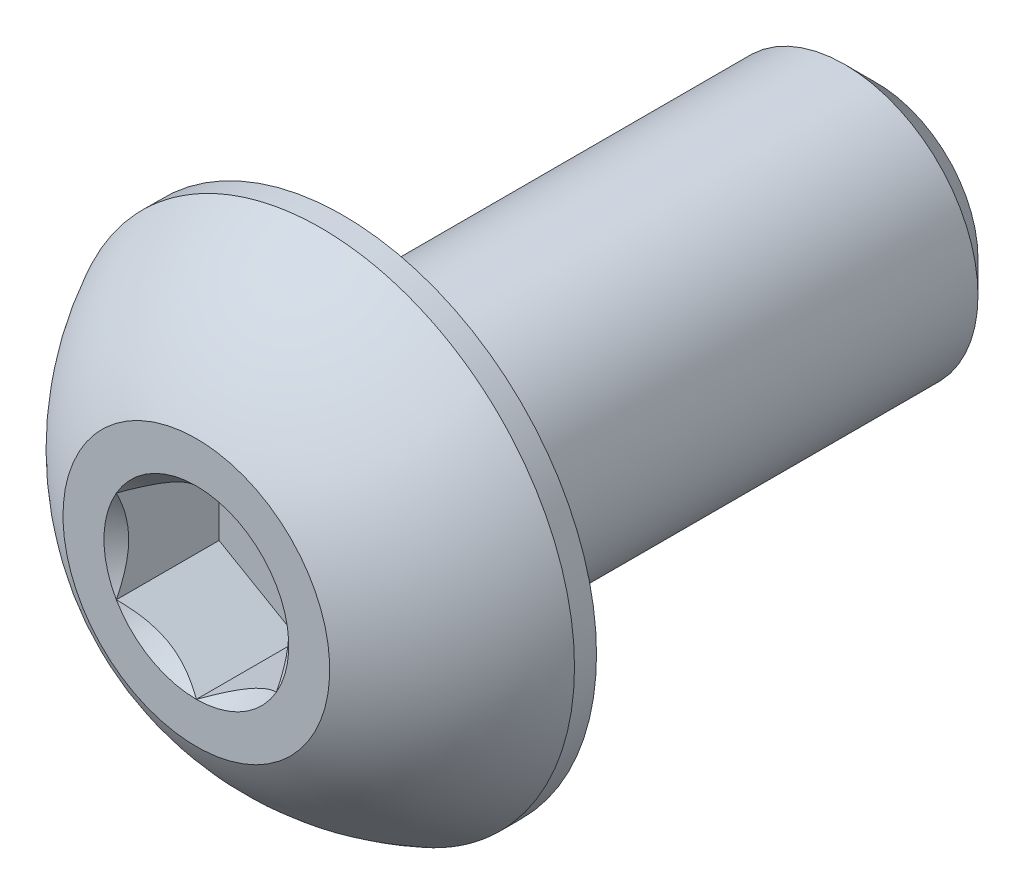
ISO-10303-21;
HEADER;
FILE_DESCRIPTION(('STEP AP214'),'2;1');
FILE_NAME('part.step','',(''),(''),'','','');
FILE_SCHEMA(('AUTOMOTIVE_DESIGN { 1 0 10303 214 1 1 1 1 }'));
ENDSEC;
DATA;
#1=APPLICATION_CONTEXT('core data for automotive mechanical design processes');
#2=APPLICATION_PROTOCOL_DEFINITION('international standard','automotive_design',2000,#1);
#3=PRODUCT_CONTEXT('',#1,'mechanical');
#4=PRODUCT('Part','Part','',(#3));
#5=PRODUCT_RELATED_PRODUCT_CATEGORY('part','',(#4));
#6=PRODUCT_DEFINITION_FORMATION('','',#4);
#7=PRODUCT_DEFINITION_CONTEXT('part definition',#1,'design');
#8=PRODUCT_DEFINITION('design','',#6,#7);
#9=PRODUCT_DEFINITION_SHAPE('','',#8);
#10=(LENGTH_UNIT() NAMED_UNIT(*) SI_UNIT(.MILLI.,.METRE.));
#11=(NAMED_UNIT(*) PLANE_ANGLE_UNIT() SI_UNIT($,.RADIAN.));
#12=(NAMED_UNIT(*) SI_UNIT($,.STERADIAN.) SOLID_ANGLE_UNIT());
#13=UNCERTAINTY_MEASURE_WITH_UNIT(LENGTH_MEASURE(1.E-05),#10,'distance_accuracy_value','');
#14=(GEOMETRIC_REPRESENTATION_CONTEXT(3) GLOBAL_UNCERTAINTY_ASSIGNED_CONTEXT((#13)) GLOBAL_UNIT_ASSIGNED_CONTEXT((#10,
#11,#12)) REPRESENTATION_CONTEXT('',''));
#15=CARTESIAN_POINT('',(0.,0.,0.));
#16=DIRECTION('',(0.,0.,1.));
#17=DIRECTION('',(1.,0.,0.));
#18=AXIS2_PLACEMENT_3D('',#15,#16,#17);
#19=CARTESIAN_POINT('',(1.5,-0.866025403784438,-1.925));
#20=DIRECTION('',(0.,0.,1.));
#21=DIRECTION('',(1.,0.,0.));
#22=AXIS2_PLACEMENT_3D('',#19,#20,#21);
#23=PLANE('',#22);
#24=DIRECTION('',(0.,1.,0.));
#25=VECTOR('',#24,1.);
#26=CARTESIAN_POINT('',(-1.5,0.866025403784438,-1.925));
#27=LINE('',#26,#25);
#28=CARTESIAN_POINT('',(-1.5,0.866025403784439,-1.925));
#29=VERTEX_POINT('',#28);
#30=CARTESIAN_POINT('',(-1.5,-0.866025403784439,-1.925));
#31=VERTEX_POINT('',#30);
#32=EDGE_CURVE('E67',#29,#31,#27,.F.);
#33=ORIENTED_EDGE('',*,*,#32,.T.);
#34=DIRECTION('',(0.866025403784439,-0.5,0.));
#35=VECTOR('',#34,1.);
#36=CARTESIAN_POINT('',(-1.5,-0.866025403784439,-1.925));
#37=LINE('',#36,#35);
#38=CARTESIAN_POINT('',(0.,-1.73205080756888,-1.925));
#39=VERTEX_POINT('',#38);
#40=EDGE_CURVE('E81',#31,#39,#37,.T.);
#41=ORIENTED_EDGE('',*,*,#40,.T.);
#42=DIRECTION('',(0.866025403784438,0.5,0.));
#43=VECTOR('',#42,1.);
#44=CARTESIAN_POINT('',(0.,-1.73205080756888,-1.925));
#45=LINE('',#44,#43);
#46=CARTESIAN_POINT('',(1.5,-0.866025403784439,-1.925));
#47=VERTEX_POINT('',#46);
#48=EDGE_CURVE('E84',#39,#47,#45,.T.);
#49=ORIENTED_EDGE('',*,*,#48,.T.);
#50=DIRECTION('',(0.,1.,0.));
#51=VECTOR('',#50,1.);
#52=CARTESIAN_POINT('',(1.5,-0.866025403784438,-1.925));
#53=LINE('',#52,#51);
#54=CARTESIAN_POINT('',(1.5,0.866025403784439,-1.925));
#55=VERTEX_POINT('',#54);
#56=EDGE_CURVE('E93',#47,#55,#53,.T.);
#57=ORIENTED_EDGE('',*,*,#56,.T.);
#58=DIRECTION('',(-0.866025403784439,0.5,0.));
#59=VECTOR('',#58,1.);
#60=CARTESIAN_POINT('',(1.5,0.866025403784439,-1.925));
#61=LINE('',#60,#59);
#62=CARTESIAN_POINT('',(0.,1.73205080756888,-1.925));
#63=VERTEX_POINT('',#62);
#64=EDGE_CURVE('E265',#55,#63,#61,.T.);
#65=ORIENTED_EDGE('',*,*,#64,.T.);
#66=DIRECTION('',(-0.866025403784438,-0.5,0.));
#67=VECTOR('',#66,1.);
#68=CARTESIAN_POINT('',(0.,1.73205080756888,-1.925));
#69=LINE('',#68,#67);
#70=EDGE_CURVE('E72',#63,#29,#69,.T.);
#71=ORIENTED_EDGE('',*,*,#70,.T.);
#72=EDGE_LOOP('',(#33,#41,#49,#57,#65,#71));
#73=FACE_BOUND('',#72,.T.);
#74=ADVANCED_FACE('F17',(#73),#23,.T.);
#75=CARTESIAN_POINT('',(-1.5,-0.866025403784439,-1.925));
#76=DIRECTION('',(-0.5,-0.866025403784439,0.));
#77=DIRECTION('',(0.866025403784439,-0.5,0.));
#78=AXIS2_PLACEMENT_3D('',#75,#76,#77);
#79=PLANE('',#78);
#80=CARTESIAN_POINT('',(-1.50000000002453,-0.866025403770048,-3.49730883349403E-11));
#81=CARTESIAN_POINT('',(-1.44844426727117,-0.895791119953617,-0.0297371504849993));
#82=CARTESIAN_POINT('',(-1.39602652187328,-0.926054519369461,-0.0577274997332096));
#83=CARTESIAN_POINT('',(-1.28914135977816,-0.9877646964775,-0.108976634295228));
#84=CARTESIAN_POINT('',(-1.23466378385068,-1.01921733960401,-0.132206913925155));
#85=CARTESIAN_POINT('',(-1.12481242363947,-1.08264005199279,-0.172000539063643));
#86=CARTESIAN_POINT('',(-1.06946660011449,-1.11459397810346,-0.188663877355987));
#87=CARTESIAN_POINT('',(-0.95755685533188,-1.17920509937865,-0.214336924391904));
#88=CARTESIAN_POINT('',(-0.900996350293105,-1.21186032218828,-0.223365789908325));
#89=CARTESIAN_POINT('',(-0.803509072843295,-1.26814462806649,-0.231512589340654));
#90=CARTESIAN_POINT('',(-0.762708138141556,-1.29170105869973,-0.232718117543908));
#91=CARTESIAN_POINT('',(-0.68117834074718,-1.33877230917235,-0.230683861819339));
#92=CARTESIAN_POINT('',(-0.640449495964758,-1.36228711867126,-0.22744309593466));
#93=CARTESIAN_POINT('',(-0.559384065201953,-1.40909026694414,-0.216702694706976));
#94=CARTESIAN_POINT('',(-0.51904787950441,-1.4323783746147,-0.20919909909419));
#95=CARTESIAN_POINT('',(-0.439052551258332,-1.47856369891149,-0.19034052638936));
#96=CARTESIAN_POINT('',(-0.399393706909126,-1.50146074337225,-0.178983896683506));
#97=CARTESIAN_POINT('',(-0.297850129661508,-1.56008695503064,-0.145281418581615));
#98=CARTESIAN_POINT('',(-0.236594120185608,-1.59545312859103,-0.120399016466317));
#99=CARTESIAN_POINT('',(-0.146523888893023,-1.64745520087378,-0.0783962697862533));
#100=CARTESIAN_POINT('',(-0.116842951449675,-1.6645914980965,-0.0636393457173694));
#101=CARTESIAN_POINT('',(-0.0580266310224323,-1.69854911652791,-0.0327784720806824));
#102=CARTESIAN_POINT('',(-0.0288909964375011,-1.71537058299853,-0.0166751634684283));
#103=CARTESIAN_POINT('',(2.46562120663875E-11,-1.73205080758311,-3.5066995750627E-11));
#104=B_SPLINE_CURVE_WITH_KNOTS('',3,(#80,#81,#82,#83,#84,#85,#86,#87,#88,#89,#90,#91,#92,#93,
#94,#95,#96,#97,#98,#99,#100,#101,#102,#103),.UNSPECIFIED.,.F.,.F.,(4,2,2,2,2,2,2,2,2,2,2,4),
(0.,0.199774419910088,0.4007123122777,0.598459990337994,0.795709985707602,0.936894690871223,
1.07811058146816,1.21945788001607,1.36086588096647,1.58533909988034,1.69726364731887,
1.80913521242832),.UNSPECIFIED.);
#105=CARTESIAN_POINT('',(-1.50000000002135,-0.866025403796764,-2.4651077774769E-11));
#106=VERTEX_POINT('',#105);
#107=CARTESIAN_POINT('',(-3.03592605946672E-11,-1.73205080760065,-1.75295343369276E-11));
#108=VERTEX_POINT('',#107);
#109=EDGE_CURVE('E20',#106,#108,#104,.T.);
#110=ORIENTED_EDGE('',*,*,#109,.T.);
#111=DIRECTION('',(0.,0.,1.));
#112=VECTOR('',#111,1.);
#113=CARTESIAN_POINT('',(0.,-1.73205080756888,-1.925));
#114=LINE('',#113,#112);
#115=EDGE_CURVE('E88',#108,#39,#114,.F.);
#116=ORIENTED_EDGE('',*,*,#115,.T.);
#117=ORIENTED_EDGE('',*,*,#40,.F.);
#118=DIRECTION('',(0.,0.,1.));
#119=VECTOR('',#118,1.);
#120=CARTESIAN_POINT('',(-1.5,-0.866025403784439,-1.925));
#121=LINE('',#120,#119);
#122=EDGE_CURVE('E59',#31,#106,#121,.T.);
#123=ORIENTED_EDGE('',*,*,#122,.T.);
#124=EDGE_LOOP('',(#110,#116,#117,#123));
#125=FACE_BOUND('',#124,.T.);
#126=ADVANCED_FACE('F89',(#125),#79,.F.);
#127=CARTESIAN_POINT('',(0.,-1.73205080756888,-1.925));
#128=DIRECTION('',(0.5,-0.866025403784438,0.));
#129=DIRECTION('',(0.866025403784438,0.5,0.));
#130=AXIS2_PLACEMENT_3D('',#127,#128,#129);
#131=PLANE('',#130);
#132=CARTESIAN_POINT('',(-2.47283241622989E-11,-1.73205080758293,-3.49712886177983E-11));
#133=CARTESIAN_POINT('',(0.0515557327287634,-1.70228509139958,-0.0297371504849972));
#134=CARTESIAN_POINT('',(0.103973478126704,-1.67202169198382,-0.0577274997332075));
#135=CARTESIAN_POINT('',(0.210858640221864,-1.61031151487585,-0.108976634295226));
#136=CARTESIAN_POINT('',(0.265336216149329,-1.57885887174931,-0.132206913925153));
#137=CARTESIAN_POINT('',(0.375187576360524,-1.51543615936052,-0.172000539063641));
#138=CARTESIAN_POINT('',(0.430533399885509,-1.48348223324986,-0.188663877355984));
#139=CARTESIAN_POINT('',(0.542443144668122,-1.41887111197467,-0.214336924391901));
#140=CARTESIAN_POINT('',(0.599003649706896,-1.38621588916504,-0.223365789908323));
#141=CARTESIAN_POINT('',(0.696490927156706,-1.32993158328682,-0.231512589340651));
#142=CARTESIAN_POINT('',(0.737291861858445,-1.30637515265359,-0.232718117543906));
#143=CARTESIAN_POINT('',(0.818821659252821,-1.25930390218097,-0.230683861819337));
#144=CARTESIAN_POINT('',(0.859550504035243,-1.23578909268205,-0.227443095934658));
#145=CARTESIAN_POINT('',(0.940615934798048,-1.18898594440918,-0.216702694706974));
#146=CARTESIAN_POINT('',(0.980952120495591,-1.16569783673862,-0.209199099094188));
#147=CARTESIAN_POINT('',(1.06094744874167,-1.11951251244183,-0.190340526389358));
#148=CARTESIAN_POINT('',(1.10060629309087,-1.09661546798107,-0.178983896683504));
#149=CARTESIAN_POINT('',(1.20214987033849,-1.03798925632268,-0.145281418581614));
#150=CARTESIAN_POINT('',(1.26340587981439,-1.00262308276228,-0.120399016466316));
#151=CARTESIAN_POINT('',(1.35347611110698,-0.950621010479539,-0.0783962697862523));
#152=CARTESIAN_POINT('',(1.38315704855032,-0.933484713256822,-0.0636393457173685));
#153=CARTESIAN_POINT('',(1.44197336897757,-0.89952709482541,-0.0327784720806818));
#154=CARTESIAN_POINT('',(1.4711090035625,-0.882705628354789,-0.0166751634684277));
#155=CARTESIAN_POINT('',(1.50000000002466,-0.866025403770206,-3.50662371950392E-11));
#156=B_SPLINE_CURVE_WITH_KNOTS('',3,(#132,#133,#134,#135,#136,#137,#138,#139,#140,#141,#142,
#143,#144,#145,#146,#147,#148,#149,#150,#151,#152,#153,#154,#155),.UNSPECIFIED.,.F.,.F.,(4,2,2,
2,2,2,2,2,2,2,2,4),(0.,0.199774419910088,0.400712312277699,0.598459990337993,0.795709985707601,
0.936894690871222,1.07811058146816,1.21945788001607,1.36086588096647,1.58533909988034,
1.69726364731887,1.80913521242832),.UNSPECIFIED.);
#157=CARTESIAN_POINT('',(1.50000000001233,-0.866025403826621,-1.7529131224469E-11));
#158=VERTEX_POINT('',#157);
#159=EDGE_CURVE('E202',#108,#158,#156,.T.);
#160=ORIENTED_EDGE('',*,*,#159,.T.);
#161=DIRECTION('',(0.,0.,-1.));
#162=VECTOR('',#161,1.);
#163=CARTESIAN_POINT('',(1.5,-0.866025403784439,-1.925));
#164=LINE('',#163,#162);
#165=EDGE_CURVE('E97',#158,#47,#164,.T.);
#166=ORIENTED_EDGE('',*,*,#165,.T.);
#167=ORIENTED_EDGE('',*,*,#48,.F.);
#168=ORIENTED_EDGE('',*,*,#115,.F.);
#169=EDGE_LOOP('',(#160,#166,#167,#168));
#170=FACE_BOUND('',#169,.T.);
#171=ADVANCED_FACE('F95',(#170),#131,.F.);
#172=CARTESIAN_POINT('',(1.5,-0.866025403784438,-1.925));
#173=DIRECTION('',(1.,0.,0.));
#174=DIRECTION('',(0.,0.,-1.));
#175=AXIS2_PLACEMENT_3D('',#172,#173,#174);
#176=PLANE('',#175);
#177=CARTESIAN_POINT('',(1.4999999999998,-0.866025403812882,-3.49731948477309E-11));
#178=CARTESIAN_POINT('',(1.49999999999993,-0.806493971458483,-0.0297371504859726));
#179=CARTESIAN_POINT('',(1.49999999999998,-0.745967172639481,-0.0577274997356718));
#180=CARTESIAN_POINT('',(1.50000000000002,-0.622546818448653,-0.108976634302055));
#181=CARTESIAN_POINT('',(1.50000000000001,-0.559641532208188,-0.132206913934862));
#182=CARTESIAN_POINT('',(1.5,-0.432796107455125,-0.172000539080811));
#183=CARTESIAN_POINT('',(1.5,-0.368888255245699,-0.188663877377684));
#184=CARTESIAN_POINT('',(1.5,-0.239666012718551,-0.214336924424236));
#185=CARTESIAN_POINT('',(1.5,-0.174355567110582,-0.223365789946761));
#186=CARTESIAN_POINT('',(1.5,-0.0617869553803679,-0.231512589389946));
#187=CARTESIAN_POINT('',(1.5,-0.0146740941290628,-0.232718117598397));
#188=CARTESIAN_POINT('',(1.5,0.0794684067864031,-0.230683861885897));
#189=CARTESIAN_POINT('',(1.5,0.126498025769629,-0.227443096008093));
#190=CARTESIAN_POINT('',(1.5,0.22010432228685,-0.21670269479537));
#191=CARTESIAN_POINT('',(1.5,0.266680537614034,-0.209199099190673));
#192=CARTESIAN_POINT('',(1.5,0.359051186180354,-0.190340526502742));
#193=CARTESIAN_POINT('',(1.5,0.404845275088565,-0.178983896805698));
#194=CARTESIAN_POINT('',(1.5,0.522097698449399,-0.145281418704612));
#195=CARTESIAN_POINT('',(1.5,0.592830045625335,-0.120399016572433));
#196=CARTESIAN_POINT('',(1.5,0.69683419026976,-0.0783962698582894));
#197=CARTESIAN_POINT('',(1.5,0.731106784740956,-0.0636393457765502));
#198=CARTESIAN_POINT('',(1.5,0.799022021654026,-0.0327784721118594));
#199=CARTESIAN_POINT('',(1.5,0.832664954619755,-0.0166751634844621));
#200=CARTESIAN_POINT('',(1.5,0.866025403812908,-3.5067301240063E-11));
#201=B_SPLINE_CURVE_WITH_KNOTS('',3,(#177,#178,#179,#180,#181,#182,#183,#184,#185,#186,#187,
#188,#189,#190,#191,#192,#193,#194,#195,#196,#197,#198,#199,#200),.UNSPECIFIED.,.F.,.F.,(4,2,2,
2,2,2,2,2,2,2,2,4),(0.,0.199774419877746,0.400712312213007,0.598459990242251,0.795709985580833,
0.936894690699465,1.07811058125136,1.21945787975417,1.36086588065946,1.58533909974464,
1.69726364726936,1.80913521246463),.UNSPECIFIED.);
#202=CARTESIAN_POINT('',(1.5000000000427,0.866025403774031,-1.75296331798823E-11));
#203=VERTEX_POINT('',#202);
#204=EDGE_CURVE('E184',#158,#203,#201,.T.);
#205=ORIENTED_EDGE('',*,*,#204,.T.);
#206=DIRECTION('',(0.,0.,1.));
#207=VECTOR('',#206,1.);
#208=CARTESIAN_POINT('',(1.5,0.866025403784439,-1.925));
#209=LINE('',#208,#207);
#210=EDGE_CURVE('E262',#203,#55,#209,.F.);
#211=ORIENTED_EDGE('',*,*,#210,.T.);
#212=ORIENTED_EDGE('',*,*,#56,.F.);
#213=ORIENTED_EDGE('',*,*,#165,.F.);
#214=EDGE_LOOP('',(#205,#211,#212,#213));
#215=FACE_BOUND('',#214,.T.);
#216=ADVANCED_FACE('F174',(#215),#176,.F.);
#217=CARTESIAN_POINT('',(1.5,0.866025403784439,-1.925));
#218=DIRECTION('',(0.5,0.866025403784439,0.));
#219=DIRECTION('',(-0.866025403784439,0.5,0.));
#220=AXIS2_PLACEMENT_3D('',#217,#218,#219);
#221=PLANE('',#220);
#222=CARTESIAN_POINT('',(1.50000000002453,0.866025403770048,-3.4973253111955E-11));
#223=CARTESIAN_POINT('',(1.44844426727117,0.895791119953617,-0.0297371504849994));
#224=CARTESIAN_POINT('',(1.39602652187328,0.926054519369461,-0.0577274997332097));
#225=CARTESIAN_POINT('',(1.28914135977816,0.987764696477501,-0.108976634295228));
#226=CARTESIAN_POINT('',(1.23466378385068,1.01921733960401,-0.132206913925155));
#227=CARTESIAN_POINT('',(1.12481242363947,1.08264005199279,-0.172000539063643));
#228=CARTESIAN_POINT('',(1.06946660011449,1.11459397810346,-0.188663877355987));
#229=CARTESIAN_POINT('',(0.95755685533188,1.17920509937865,-0.214336924391904));
#230=CARTESIAN_POINT('',(0.900996350293104,1.21186032218828,-0.223365789908325));
#231=CARTESIAN_POINT('',(0.803509072843295,1.26814462806649,-0.231512589340654));
#232=CARTESIAN_POINT('',(0.762708138141556,1.29170105869973,-0.232718117543908));
#233=CARTESIAN_POINT('',(0.68117834074718,1.33877230917235,-0.230683861819339));
#234=CARTESIAN_POINT('',(0.640449495964758,1.36228711867126,-0.22744309593466));
#235=CARTESIAN_POINT('',(0.559384065201953,1.40909026694414,-0.216702694706976));
#236=CARTESIAN_POINT('',(0.51904787950441,1.4323783746147,-0.20919909909419));
#237=CARTESIAN_POINT('',(0.439052551258333,1.47856369891149,-0.19034052638936));
#238=CARTESIAN_POINT('',(0.399393706909126,1.50146074337225,-0.178983896683506));
#239=CARTESIAN_POINT('',(0.297850129661507,1.56008695503064,-0.145281418581616));
#240=CARTESIAN_POINT('',(0.236594120185608,1.59545312859103,-0.120399016466317));
#241=CARTESIAN_POINT('',(0.146523888893023,1.64745520087378,-0.0783962697862531));
#242=CARTESIAN_POINT('',(0.116842951449674,1.6645914980965,-0.0636393457173692));
#243=CARTESIAN_POINT('',(0.0580266310224316,1.69854911652791,-0.0327784720806821));
#244=CARTESIAN_POINT('',(0.0288909964375004,1.71537058299853,-0.0166751634684281));
#245=CARTESIAN_POINT('',(-2.46568834570738E-11,1.73205080758311,-3.50665978158375E-11));
#246=B_SPLINE_CURVE_WITH_KNOTS('',3,(#222,#223,#224,#225,#226,#227,#228,#229,#230,#231,#232,
#233,#234,#235,#236,#237,#238,#239,#240,#241,#242,#243,#244,#245),.UNSPECIFIED.,.F.,.F.,(4,2,2,
2,2,2,2,2,2,2,2,4),(0.,0.199774419910088,0.400712312277699,0.598459990337994,0.795709985707602,
0.936894690871222,1.07811058146816,1.21945788001607,1.36086588096647,1.58533909988034,
1.69726364731887,1.80913521242832),.UNSPECIFIED.);
#247=CARTESIAN_POINT('',(3.03590397906963E-11,1.73205080760065,-1.75294164449582E-11));
#248=VERTEX_POINT('',#247);
#249=EDGE_CURVE('E178',#203,#248,#246,.T.);
#250=ORIENTED_EDGE('',*,*,#249,.T.);
#251=DIRECTION('',(0.,0.,1.));
#252=VECTOR('',#251,1.);
#253=CARTESIAN_POINT('',(0.,1.73205080756888,-1.925));
#254=LINE('',#253,#252);
#255=EDGE_CURVE('E257',#248,#63,#254,.F.);
#256=ORIENTED_EDGE('',*,*,#255,.T.);
#257=ORIENTED_EDGE('',*,*,#64,.F.);
#258=ORIENTED_EDGE('',*,*,#210,.F.);
#259=EDGE_LOOP('',(#250,#256,#257,#258));
#260=FACE_BOUND('',#259,.T.);
#261=ADVANCED_FACE('F170',(#260),#221,.F.);
#262=CARTESIAN_POINT('',(0.,1.73205080756888,-1.925));
#263=DIRECTION('',(-0.5,0.866025403784438,0.));
#264=DIRECTION('',(-0.866025403784438,-0.5,0.));
#265=AXIS2_PLACEMENT_3D('',#262,#263,#264);
#266=PLANE('',#265);
#267=CARTESIAN_POINT('',(2.47278634993487E-11,1.73205080758293,-3.49716904690521E-11));
#268=CARTESIAN_POINT('',(-0.0515557327287638,1.70228509139958,-0.0297371504849977));
#269=CARTESIAN_POINT('',(-0.103973478126705,1.67202169198382,-0.0577274997332079));
#270=CARTESIAN_POINT('',(-0.210858640221864,1.61031151487585,-0.108976634295226));
#271=CARTESIAN_POINT('',(-0.26533621614933,1.57885887174931,-0.132206913925153));
#272=CARTESIAN_POINT('',(-0.375187576360525,1.51543615936052,-0.172000539063641));
#273=CARTESIAN_POINT('',(-0.430533399885509,1.48348223324986,-0.188663877355985));
#274=CARTESIAN_POINT('',(-0.542443144668123,1.41887111197467,-0.214336924391901));
#275=CARTESIAN_POINT('',(-0.599003649706897,1.38621588916504,-0.223365789908323));
#276=CARTESIAN_POINT('',(-0.696490927156706,1.32993158328682,-0.231512589340651));
#277=CARTESIAN_POINT('',(-0.737291861858445,1.30637515265359,-0.232718117543906));
#278=CARTESIAN_POINT('',(-0.818821659252822,1.25930390218097,-0.230683861819337));
#279=CARTESIAN_POINT('',(-0.859550504035244,1.23578909268205,-0.227443095934658));
#280=CARTESIAN_POINT('',(-0.940615934798048,1.18898594440918,-0.216702694706974));
#281=CARTESIAN_POINT('',(-0.980952120495591,1.16569783673862,-0.209199099094188));
#282=CARTESIAN_POINT('',(-1.06094744874167,1.11951251244183,-0.190340526389358));
#283=CARTESIAN_POINT('',(-1.10060629309088,1.09661546798107,-0.178983896683504));
#284=CARTESIAN_POINT('',(-1.20214987033849,1.03798925632268,-0.145281418581613));
#285=CARTESIAN_POINT('',(-1.26340587981439,1.00262308276228,-0.120399016466315));
#286=CARTESIAN_POINT('',(-1.35347611110698,0.950621010479539,-0.0783962697862516));
#287=CARTESIAN_POINT('',(-1.38315704855033,0.933484713256821,-0.0636393457173678));
#288=CARTESIAN_POINT('',(-1.44197336897757,0.899527094825409,-0.0327784720806811));
#289=CARTESIAN_POINT('',(-1.4711090035625,0.882705628354789,-0.0166751634684272));
#290=CARTESIAN_POINT('',(-1.50000000002466,0.866025403770206,-3.50659196153753E-11));
#291=B_SPLINE_CURVE_WITH_KNOTS('',3,(#267,#268,#269,#270,#271,#272,#273,#274,#275,#276,#277,
#278,#279,#280,#281,#282,#283,#284,#285,#286,#287,#288,#289,#290),.UNSPECIFIED.,.F.,.F.,(4,2,2,
2,2,2,2,2,2,2,2,4),(0.,0.199774419910088,0.400712312277699,0.598459990337993,0.795709985707601,
0.936894690871222,1.07811058146816,1.21945788001607,1.36086588096647,1.58533909988034,
1.69726364731887,1.80913521242832),.UNSPECIFIED.);
#292=CARTESIAN_POINT('',(-1.50000000001233,0.86602540382662,-1.75290210342841E-11));
#293=VERTEX_POINT('',#292);
#294=EDGE_CURVE('E40',#248,#293,#291,.T.);
#295=ORIENTED_EDGE('',*,*,#294,.T.);
#296=DIRECTION('',(0.,0.,1.));
#297=VECTOR('',#296,1.);
#298=CARTESIAN_POINT('',(-1.5,0.866025403784438,-1.925));
#299=LINE('',#298,#297);
#300=EDGE_CURVE('E250',#293,#29,#299,.F.);
#301=ORIENTED_EDGE('',*,*,#300,.T.);
#302=ORIENTED_EDGE('',*,*,#70,.F.);
#303=ORIENTED_EDGE('',*,*,#255,.F.);
#304=EDGE_LOOP('',(#295,#301,#302,#303));
#305=FACE_BOUND('',#304,.T.);
#306=ADVANCED_FACE('F163',(#305),#266,.F.);
#307=CARTESIAN_POINT('',(-1.5,0.866025403784438,-1.925));
#308=DIRECTION('',(-1.,0.,0.));
#309=DIRECTION('',(0.,0.,1.));
#310=AXIS2_PLACEMENT_3D('',#307,#308,#309);
#311=PLANE('',#310);
#312=CARTESIAN_POINT('',(-1.4999999999998,0.866025403812881,-3.49736894377255E-11));
#313=CARTESIAN_POINT('',(-1.49999999999993,0.806493971458482,-0.0297371504859727));
#314=CARTESIAN_POINT('',(-1.49999999999998,0.74596717263948,-0.0577274997356719));
#315=CARTESIAN_POINT('',(-1.50000000000002,0.622546818448652,-0.108976634302056));
#316=CARTESIAN_POINT('',(-1.50000000000001,0.559641532208187,-0.132206913934863));
#317=CARTESIAN_POINT('',(-1.5,0.432796107455124,-0.172000539080812));
#318=CARTESIAN_POINT('',(-1.5,0.368888255245698,-0.188663877377684));
#319=CARTESIAN_POINT('',(-1.5,0.23966601271855,-0.214336924424236));
#320=CARTESIAN_POINT('',(-1.5,0.174355567110582,-0.223365789946761));
#321=CARTESIAN_POINT('',(-1.5,0.0617869553803675,-0.231512589389946));
#322=CARTESIAN_POINT('',(-1.5,0.0146740941290625,-0.232718117598397));
#323=CARTESIAN_POINT('',(-1.5,-0.0794684067864032,-0.230683861885897));
#324=CARTESIAN_POINT('',(-1.5,-0.126498025769629,-0.227443096008093));
#325=CARTESIAN_POINT('',(-1.5,-0.22010432228685,-0.21670269479537));
#326=CARTESIAN_POINT('',(-1.5,-0.266680537614034,-0.209199099190673));
#327=CARTESIAN_POINT('',(-1.5,-0.359051186180354,-0.190340526502742));
#328=CARTESIAN_POINT('',(-1.5,-0.404845275088566,-0.178983896805698));
#329=CARTESIAN_POINT('',(-1.5,-0.522097698449399,-0.145281418704612));
#330=CARTESIAN_POINT('',(-1.5,-0.592830045625335,-0.120399016572433));
#331=CARTESIAN_POINT('',(-1.5,-0.69683419026976,-0.0783962698582894));
#332=CARTESIAN_POINT('',(-1.5,-0.731106784740956,-0.0636393457765503));
#333=CARTESIAN_POINT('',(-1.5,-0.799022021654026,-0.0327784721118596));
#334=CARTESIAN_POINT('',(-1.5,-0.832664954619755,-0.0166751634844622));
#335=CARTESIAN_POINT('',(-1.5,-0.866025403812908,-3.50673251714009E-11));
#336=B_SPLINE_CURVE_WITH_KNOTS('',3,(#312,#313,#314,#315,#316,#317,#318,#319,#320,#321,#322,
#323,#324,#325,#326,#327,#328,#329,#330,#331,#332,#333,#334,#335),.UNSPECIFIED.,.F.,.F.,(4,2,2,
2,2,2,2,2,2,2,2,4),(0.,0.199774419877746,0.400712312213007,0.598459990242251,0.795709985580833,
0.936894690699464,1.07811058125136,1.21945787975417,1.36086588065945,1.58533909974464,
1.69726364726936,1.80913521246463),.UNSPECIFIED.);
#337=EDGE_CURVE('E143',#293,#106,#336,.T.);
#338=ORIENTED_EDGE('',*,*,#337,.T.);
#339=ORIENTED_EDGE('',*,*,#122,.F.);
#340=ORIENTED_EDGE('',*,*,#32,.F.);
#341=ORIENTED_EDGE('',*,*,#300,.F.);
#342=EDGE_LOOP('',(#338,#339,#340,#341));
#343=FACE_BOUND('',#342,.T.);
#344=ADVANCED_FACE('F159',(#343),#311,.F.);
#345=CARTESIAN_POINT('',(0.,0.,0.));
#346=DIRECTION('',(0.,0.,1.));
#347=DIRECTION('',(1.,0.,0.));
#348=AXIS2_PLACEMENT_3D('',#345,#346,#347);
#349=CONICAL_SURFACE('',#348,1.73205080761818,0.785398163519197);
#350=ORIENTED_EDGE('',*,*,#109,.F.);
#351=CARTESIAN_POINT('',(0.,0.,0.));
#352=DIRECTION('',(0.,0.,1.));
#353=DIRECTION('',(1.,0.,0.));
#354=AXIS2_PLACEMENT_3D('',#351,#352,#353);
#355=CIRCLE('',#354,1.73205080761818);
#356=EDGE_CURVE('E151',#106,#108,#355,.T.);
#357=ORIENTED_EDGE('',*,*,#356,.T.);
#358=EDGE_LOOP('',(#350,#357));
#359=FACE_BOUND('',#358,.T.);
#360=ADVANCED_FACE('F162',(#359),#349,.F.);
#361=CARTESIAN_POINT('',(0.,0.,0.));
#362=DIRECTION('',(0.,0.,1.));
#363=DIRECTION('',(1.,0.,0.));
#364=AXIS2_PLACEMENT_3D('',#361,#362,#363);
#365=CONICAL_SURFACE('',#364,1.73205080761818,0.785398163519197);
#366=ORIENTED_EDGE('',*,*,#159,.F.);
#367=CARTESIAN_POINT('',(0.,0.,0.));
#368=DIRECTION('',(0.,0.,1.));
#369=DIRECTION('',(1.,0.,0.));
#370=AXIS2_PLACEMENT_3D('',#367,#368,#369);
#371=CIRCLE('',#370,1.73205080761818);
#372=EDGE_CURVE('E303',#108,#158,#371,.T.);
#373=ORIENTED_EDGE('',*,*,#372,.T.);
#374=EDGE_LOOP('',(#366,#373));
#375=FACE_BOUND('',#374,.T.);
#376=ADVANCED_FACE('F197',(#375),#365,.F.);
#377=CARTESIAN_POINT('',(0.,0.,0.));
#378=DIRECTION('',(0.,0.,1.));
#379=DIRECTION('',(1.,0.,0.));
#380=AXIS2_PLACEMENT_3D('',#377,#378,#379);
#381=CONICAL_SURFACE('',#380,1.73205080761818,0.785398163397448);
#382=CARTESIAN_POINT('',(0.,0.,0.));
#383=DIRECTION('',(0.,0.,1.));
#384=DIRECTION('',(1.,0.,0.));
#385=AXIS2_PLACEMENT_3D('',#382,#383,#384);
#386=CIRCLE('',#385,1.73205080761818);
#387=EDGE_CURVE('E304',#158,#203,#386,.T.);
#388=ORIENTED_EDGE('',*,*,#387,.T.);
#389=ORIENTED_EDGE('',*,*,#204,.F.);
#390=EDGE_LOOP('',(#388,#389));
#391=FACE_BOUND('',#390,.T.);
#392=ADVANCED_FACE('F193',(#391),#381,.F.);
#393=CARTESIAN_POINT('',(0.,0.,0.));
#394=DIRECTION('',(0.,0.,1.));
#395=DIRECTION('',(1.,0.,0.));
#396=AXIS2_PLACEMENT_3D('',#393,#394,#395);
#397=CONICAL_SURFACE('',#396,1.73205080761818,0.785398163519197);
#398=ORIENTED_EDGE('',*,*,#249,.F.);
#399=CARTESIAN_POINT('',(0.,0.,0.));
#400=DIRECTION('',(0.,0.,1.));
#401=DIRECTION('',(1.,0.,0.));
#402=AXIS2_PLACEMENT_3D('',#399,#400,#401);
#403=CIRCLE('',#402,1.73205080761818);
#404=EDGE_CURVE('E305',#203,#248,#403,.T.);
#405=ORIENTED_EDGE('',*,*,#404,.T.);
#406=EDGE_LOOP('',(#398,#405));
#407=FACE_BOUND('',#406,.T.);
#408=ADVANCED_FACE('F190',(#407),#397,.F.);
#409=CARTESIAN_POINT('',(0.,0.,0.));
#410=DIRECTION('',(0.,0.,1.));
#411=DIRECTION('',(1.,0.,0.));
#412=AXIS2_PLACEMENT_3D('',#409,#410,#411);
#413=CONICAL_SURFACE('',#412,1.73205080761818,0.785398163519197);
#414=ORIENTED_EDGE('',*,*,#294,.F.);
#415=CARTESIAN_POINT('',(0.,0.,0.));
#416=DIRECTION('',(0.,0.,1.));
#417=DIRECTION('',(1.,0.,0.));
#418=AXIS2_PLACEMENT_3D('',#415,#416,#417);
#419=CIRCLE('',#418,1.73205080761818);
#420=EDGE_CURVE('E298',#248,#293,#419,.T.);
#421=ORIENTED_EDGE('',*,*,#420,.T.);
#422=EDGE_LOOP('',(#414,#421));
#423=FACE_BOUND('',#422,.T.);
#424=ADVANCED_FACE('F138',(#423),#413,.F.);
#425=CARTESIAN_POINT('',(0.,0.,0.));
#426=DIRECTION('',(0.,0.,1.));
#427=DIRECTION('',(1.,0.,0.));
#428=AXIS2_PLACEMENT_3D('',#425,#426,#427);
#429=CONICAL_SURFACE('',#428,1.73205080761818,0.785398163397448);
#430=ORIENTED_EDGE('',*,*,#337,.F.);
#431=CARTESIAN_POINT('',(0.,0.,0.));
#432=DIRECTION('',(0.,0.,1.));
#433=DIRECTION('',(1.,0.,0.));
#434=AXIS2_PLACEMENT_3D('',#431,#432,#433);
#435=CIRCLE('',#434,1.73205080761818);
#436=EDGE_CURVE('E123',#293,#106,#435,.T.);
#437=ORIENTED_EDGE('',*,*,#436,.T.);
#438=EDGE_LOOP('',(#430,#437));
#439=FACE_BOUND('',#438,.T.);
#440=ADVANCED_FACE('F133',(#439),#429,.F.);
#441=CARTESIAN_POINT('',(0.,-2.5,0.));
#442=DIRECTION('',(0.,0.,-1.));
#443=DIRECTION('',(-1.,0.,0.));
#444=AXIS2_PLACEMENT_3D('',#441,#442,#443);
#445=PLANE('',#444);
#446=ORIENTED_EDGE('',*,*,#420,.F.);
#447=ORIENTED_EDGE('',*,*,#404,.F.);
#448=ORIENTED_EDGE('',*,*,#387,.F.);
#449=ORIENTED_EDGE('',*,*,#372,.F.);
#450=ORIENTED_EDGE('',*,*,#356,.F.);
#451=ORIENTED_EDGE('',*,*,#436,.F.);
#452=EDGE_LOOP('',(#446,#447,#448,#449,#450,#451));
#453=FACE_BOUND('',#452,.T.);
#454=CARTESIAN_POINT('',(0.,2.5,0.));
#455=CARTESIAN_POINT('',(-0.140426104916171,2.49999377288615,0.));
#456=CARTESIAN_POINT('',(-0.280954031991962,2.48812860484106,3.15786606079497E-13));
#457=CARTESIAN_POINT('',(-0.558139658492382,2.44096074902969,-3.16166902160035E-13));
#458=CARTESIAN_POINT('',(-0.694792493265144,2.40562985309161,-1.1991938830655E-12));
#459=CARTESIAN_POINT('',(-0.960172122561447,2.31253633023374,-1.20166281841789E-12));
#460=CARTESIAN_POINT('',(-1.08890266852496,2.25478441650809,-3.21946211567848E-13));
#461=CARTESIAN_POINT('',(-1.33480476215494,2.11850293856874,3.21866212850881E-13));
#462=CARTESIAN_POINT('',(-1.45197917410753,2.03997854084975,0.));
#463=CARTESIAN_POINT('',(-1.67149637287936,1.86436525899232,0.));
#464=CARTESIAN_POINT('',(-1.77383760642256,1.76727443311113,0.));
#465=CARTESIAN_POINT('',(-1.96077108972063,1.5572853703438,0.));
#466=CARTESIAN_POINT('',(-2.04536264247664,1.44438651299413,0.));
#467=CARTESIAN_POINT('',(-2.19438926048053,1.20599153577204,0.));
#468=CARTESIAN_POINT('',(-2.2588247010994,1.08049565055392,0.));
#469=CARTESIAN_POINT('',(-2.36571190425968,0.820467575206641,0.));
#470=CARTESIAN_POINT('',(-2.40816371100576,0.685935403248265,0.));
#471=CARTESIAN_POINT('',(-2.46987884513361,0.41165323576608,0.));
#472=CARTESIAN_POINT('',(-2.4891421283097,0.271903230295725,0.));
#473=CARTESIAN_POINT('',(-2.50393321907299,-0.00884700938585766,0.));
#474=CARTESIAN_POINT('',(-2.49946106942909,-0.149847241343845,0.));
#475=CARTESIAN_POINT('',(-2.46690834048228,-0.429095661105703,0.));
#476=CARTESIAN_POINT('',(-2.43882775236998,-0.567343847882638,0.));
#477=CARTESIAN_POINT('',(-2.35985521676827,-0.837163810231991,0.));
#478=CARTESIAN_POINT('',(-2.30896324519902,-0.968735578756573,0.));
#479=CARTESIAN_POINT('',(-2.1858126315262,-1.2214675666181,0.));
#480=CARTESIAN_POINT('',(-2.11355399637579,-1.34262778934316,0.));
#481=CARTESIAN_POINT('',(-1.94972129370707,-1.57109730355804,0.));
#482=CARTESIAN_POINT('',(-1.85814723400701,-1.67840660065422,0.));
#483=CARTESIAN_POINT('',(-1.65828316813495,-1.87612814061528,0.));
#484=CARTESIAN_POINT('',(-1.54999315967219,-1.96654038116456,0.));
#485=CARTESIAN_POINT('',(-1.31977122488187,-2.12790126296045,0.));
#486=CARTESIAN_POINT('',(-1.19783929677156,-2.1988499016635,0.));
#487=CARTESIAN_POINT('',(-0.943794829063063,-2.31926953799949,0.));
#488=CARTESIAN_POINT('',(-0.811682289900767,-2.36874053655201,0.));
#489=CARTESIAN_POINT('',(-0.541026888337529,-2.44480055905629,0.));
#490=CARTESIAN_POINT('',(-0.402484026226278,-2.47138958403888,0.));
#491=CARTESIAN_POINT('',(-0.122900797575727,-2.50093087897621,0.));
#492=CARTESIAN_POINT('',(0.018139568963571,-2.50388314893098,3.46961945081868E-13));
#493=CARTESIAN_POINT('',(0.298714091660324,-2.48606712714886,-3.46961960712715E-13));
#494=CARTESIAN_POINT('',(0.438248247749923,-2.46529883434335,-1.29477243391078E-12));
#495=CARTESIAN_POINT('',(0.71184938433979,-2.40063123468837,-1.13730987603765E-12));
#496=CARTESIAN_POINT('',(0.845916364605969,-2.3567319268485,0.));
#497=CARTESIAN_POINT('',(1.10477735834655,-2.24704847617179,0.));
#498=CARTESIAN_POINT('',(1.22957137303277,-2.18126433619494,-1.00916257566668E-12));
#499=CARTESIAN_POINT('',(1.46634390401786,-2.02967864834023,-1.18352788602047E-12));
#500=CARTESIAN_POINT('',(1.57832242207297,-1.94387710320556,-3.16694129312418E-13));
#501=CARTESIAN_POINT('',(1.7862852822064,-1.7546922142879,3.16694257499622E-13));
#502=CARTESIAN_POINT('',(1.8822696178108,-1.6513088633884,0.));
#503=CARTESIAN_POINT('',(2.0555193719421,-1.42989510132749,0.));
#504=CARTESIAN_POINT('',(2.13278478437748,-1.31186468539964,0.));
#505=CARTESIAN_POINT('',(2.2664032406088,-1.06450749101075,0.));
#506=CARTESIAN_POINT('',(2.32275630647994,-0.935180724474359,0.));
#507=CARTESIAN_POINT('',(2.41295047224872,-0.668901974735228,0.));
#508=CARTESIAN_POINT('',(2.4467915805466,-0.531949994377824,0.));
#509=CARTESIAN_POINT('',(2.49100125494042,-0.254308178115884,0.));
#510=CARTESIAN_POINT('',(2.50136977874099,-0.11361833547654,0.));
#511=CARTESIAN_POINT('',(2.49833983643023,0.167504919749226,0.));
#512=CARTESIAN_POINT('',(2.48494141562714,0.307938332823983,0.));
#513=CARTESIAN_POINT('',(2.43475793877014,0.584562794538375,0.));
#514=CARTESIAN_POINT('',(2.39797283569016,0.720753834646847,0.));
#515=CARTESIAN_POINT('',(2.30205936796063,0.98502964653005,0.));
#516=CARTESIAN_POINT('',(2.24293058718862,1.1131142672812,0.));
#517=CARTESIAN_POINT('',(2.10401075902967,1.3575336098139,0.));
#518=CARTESIAN_POINT('',(2.02422052292125,1.47386879269154,0.));
#519=CARTESIAN_POINT('',(1.84625229096995,1.69148114008358,0.));
#520=CARTESIAN_POINT('',(1.74807621990901,1.79275987884252,0.));
#521=CARTESIAN_POINT('',(1.53608575842464,1.97742315380663,0.));
#522=CARTESIAN_POINT('',(1.42226748721669,2.06080323621403,0.));
#523=CARTESIAN_POINT('',(1.18220372565671,2.20730286771332,0.));
#524=CARTESIAN_POINT('',(1.05595232774905,2.27041272419885,0.));
#525=CARTESIAN_POINT('',(0.79474524318476,2.37446817640476,0.));
#526=CARTESIAN_POINT('',(0.659800208998089,2.41544034072841,0.));
#527=CARTESIAN_POINT('',(0.436662637238998,2.46313736176947,0.));
#528=CARTESIAN_POINT('',(0.349919997758221,2.47694359911888,0.));
#529=CARTESIAN_POINT('',(0.175464826042706,2.49537686389633,0.));
#530=CARTESIAN_POINT('',(0.0877522938079665,2.50000389132438,0.));
#531=CARTESIAN_POINT('',(0.,2.5,0.));
#532=B_SPLINE_CURVE_WITH_KNOTS('',3,(#454,#455,#456,#457,#458,#459,#460,#461,#462,#463,#464,
#465,#466,#467,#468,#469,#470,#471,#472,#473,#474,#475,#476,#477,#478,#479,#480,#481,#482,#483,
#484,#485,#486,#487,#488,#489,#490,#491,#492,#493,#494,#495,#496,#497,#498,#499,#500,#501,#502,
#503,#504,#505,#506,#507,#508,#509,#510,#511,#512,#513,#514,#515,#516,#517,#518,#519,#520,#521,
#522,#523,#524,#525,#526,#527,#528,#529,#530,#531),.UNSPECIFIED.,.T.,.F.,(4,2,2,2,2,2,2,2,2,2,2,
2,2,2,2,2,2,2,2,2,2,2,2,2,2,2,2,2,2,2,2,2,2,2,2,2,2,2,4),(0.,0.420958019059748,
0.842422990224611,1.26368682467408,1.68484598149402,2.10604920874208,2.52726897280856,
2.94848089195443,3.36969196412426,3.7909038392729,4.21211495543997,4.63332622878055,
5.05453794675567,5.47574952765963,5.89696093807138,6.31817240620663,6.73938392938708,
7.16059543453285,7.58180692070278,8.00301840687236,8.42422991201778,8.84544143519829,
9.26665290333358,9.68786431374594,10.1090758946506,10.5302876126258,10.9514988859663,
11.3727100021334,11.793921877282,12.2151329494518,12.6363448685977,13.0575646326643,
13.4787678599123,13.8999270167319,14.3211908511815,14.742655822347,15.1636138414069,
15.4266705700074,15.689727298608),.UNSPECIFIED.);
#533=CARTESIAN_POINT('',(0.,2.5,0.));
#534=VERTEX_POINT('',#533);
#535=EDGE_CURVE('E115',#534,#534,#532,.F.);
#536=ORIENTED_EDGE('',*,*,#535,.F.);
#537=EDGE_LOOP('',(#536));
#538=FACE_BOUND('',#537,.T.);
#539=ADVANCED_FACE('F129',(#453,#538),#445,.F.);
#540=CARTESIAN_POINT('',(0.,0.,-4.65805481283422));
#541=DIRECTION('',(0.,-1.,0.));
#542=DIRECTION('',(0.,0.,-1.));
#543=AXIS2_PLACEMENT_3D('',#540,#541,#542);
#544=SPHERICAL_SURFACE('',#543,5.28653711226622);
#545=ORIENTED_EDGE('',*,*,#535,.T.);
#546=EDGE_LOOP('',(#545));
#547=FACE_BOUND('',#546,.T.);
#548=CARTESIAN_POINT('',(0.,0.,-2.3375));
#549=DIRECTION('',(0.,0.,1.));
#550=DIRECTION('',(1.,0.,0.));
#551=AXIS2_PLACEMENT_3D('',#548,#549,#550);
#552=CIRCLE('',#551,4.75);
#553=CARTESIAN_POINT('',(4.75,0.,-2.3375));
#554=VERTEX_POINT('',#553);
#555=EDGE_CURVE('E112',#554,#554,#552,.F.);
#556=ORIENTED_EDGE('',*,*,#555,.F.);
#557=EDGE_LOOP('',(#556));
#558=FACE_BOUND('',#557,.T.);
#559=ADVANCED_FACE('F125',(#547,#558),#544,.T.);
#560=CARTESIAN_POINT('',(0.,-2.5,-12.75));
#561=DIRECTION('',(0.,0.,-1.));
#562=DIRECTION('',(0.,1.,0.));
#563=AXIS2_PLACEMENT_3D('',#560,#561,#562);
#564=PLANE('',#563);
#565=CARTESIAN_POINT('',(0.,0.,-12.7499999999827));
#566=DIRECTION('',(0.,0.,1.));
#567=DIRECTION('',(1.,0.,0.));
#568=AXIS2_PLACEMENT_3D('',#565,#566,#567);
#569=CIRCLE('',#568,1.89999999992096);
#570=CARTESIAN_POINT('',(1.89999999992096,0.,-12.7499999999827));
#571=VERTEX_POINT('',#570);
#572=EDGE_CURVE('E109',#571,#571,#569,.T.);
#573=ORIENTED_EDGE('',*,*,#572,.F.);
#574=EDGE_LOOP('',(#573));
#575=FACE_BOUND('',#574,.T.);
#576=ADVANCED_FACE('F233',(#575),#564,.T.);
#577=CARTESIAN_POINT('',(0.,0.,0.));
#578=DIRECTION('',(0.,0.,1.));
#579=DIRECTION('',(1.,0.,0.));
#580=AXIS2_PLACEMENT_3D('',#577,#578,#579);
#581=CYLINDRICAL_SURFACE('',#580,4.75);
#582=CARTESIAN_POINT('',(0.,0.,-2.75));
#583=DIRECTION('',(0.,0.,1.));
#584=DIRECTION('',(1.,0.,0.));
#585=AXIS2_PLACEMENT_3D('',#582,#583,#584);
#586=CIRCLE('',#585,4.75);
#587=CARTESIAN_POINT('',(4.75,0.,-2.75));
#588=VERTEX_POINT('',#587);
#589=EDGE_CURVE('E106',#588,#588,#586,.T.);
#590=ORIENTED_EDGE('',*,*,#589,.T.);
#591=EDGE_LOOP('',(#590));
#592=FACE_BOUND('',#591,.T.);
#593=ORIENTED_EDGE('',*,*,#555,.T.);
#594=EDGE_LOOP('',(#593));
#595=FACE_BOUND('',#594,.T.);
#596=ADVANCED_FACE('F230',(#592,#595),#581,.T.);
#597=CARTESIAN_POINT('',(0.,0.,-12.1499999999628));
#598=DIRECTION('',(0.,0.,1.));
#599=DIRECTION('',(1.,0.,0.));
#600=AXIS2_PLACEMENT_3D('',#597,#598,#599);
#601=CONICAL_SURFACE('',#600,2.49999999994088,0.785398163397449);
#602=ORIENTED_EDGE('',*,*,#572,.T.);
#603=EDGE_LOOP('',(#602));
#604=FACE_BOUND('',#603,.T.);
#605=CARTESIAN_POINT('',(0.,0.,-12.15));
#606=DIRECTION('',(0.,0.,-1.));
#607=DIRECTION('',(0.,1.,0.));
#608=AXIS2_PLACEMENT_3D('',#605,#606,#607);
#609=CIRCLE('',#608,2.5);
#610=CARTESIAN_POINT('',(0.,2.5,-12.15));
#611=VERTEX_POINT('',#610);
#612=EDGE_CURVE('E31',#611,#611,#609,.F.);
#613=ORIENTED_EDGE('',*,*,#612,.F.);
#614=EDGE_LOOP('',(#613));
#615=FACE_BOUND('',#614,.T.);
#616=ADVANCED_FACE('F223',(#604,#615),#601,.T.);
#617=CARTESIAN_POINT('',(0.,-4.75,-2.75));
#618=DIRECTION('',(0.,0.,1.));
#619=DIRECTION('',(1.,0.,0.));
#620=AXIS2_PLACEMENT_3D('',#617,#618,#619);
#621=PLANE('',#620);
#622=CARTESIAN_POINT('',(0.,0.,-2.75));
#623=DIRECTION('',(0.,0.,-1.));
#624=DIRECTION('',(0.,1.,0.));
#625=AXIS2_PLACEMENT_3D('',#622,#623,#624);
#626=CIRCLE('',#625,2.5);
#627=CARTESIAN_POINT('',(0.,2.5,-2.75));
#628=VERTEX_POINT('',#627);
#629=EDGE_CURVE('E11',#628,#628,#626,.T.);
#630=ORIENTED_EDGE('',*,*,#629,.F.);
#631=EDGE_LOOP('',(#630));
#632=FACE_BOUND('',#631,.T.);
#633=ORIENTED_EDGE('',*,*,#589,.F.);
#634=EDGE_LOOP('',(#633));
#635=FACE_BOUND('',#634,.T.);
#636=ADVANCED_FACE('F217',(#632,#635),#621,.F.);
#637=CARTESIAN_POINT('',(0.,0.,-12.75));
#638=DIRECTION('',(0.,0.,-1.));
#639=DIRECTION('',(0.,1.,0.));
#640=AXIS2_PLACEMENT_3D('',#637,#638,#639);
#641=CYLINDRICAL_SURFACE('',#640,2.5);
#642=ORIENTED_EDGE('',*,*,#629,.T.);
#643=EDGE_LOOP('',(#642));
#644=FACE_BOUND('',#643,.T.);
#645=ORIENTED_EDGE('',*,*,#612,.T.);
#646=EDGE_LOOP('',(#645));
#647=FACE_BOUND('',#646,.T.);
#648=ADVANCED_FACE('F215',(#644,#647),#641,.T.);
#649=CLOSED_SHELL('',(#74,#126,#171,#216,#261,#306,#344,#360,#376,#392,#408,#424,#440,#539,#559,
#576,#596,#616,#636,#648));
#650=MANIFOLD_SOLID_BREP('B1',#649);
#651=ADVANCED_BREP_SHAPE_REPRESENTATION('',(#18,#650),#14);
#652=SHAPE_DEFINITION_REPRESENTATION(#9,#651);
ENDSEC;
END-ISO-10303-21;
